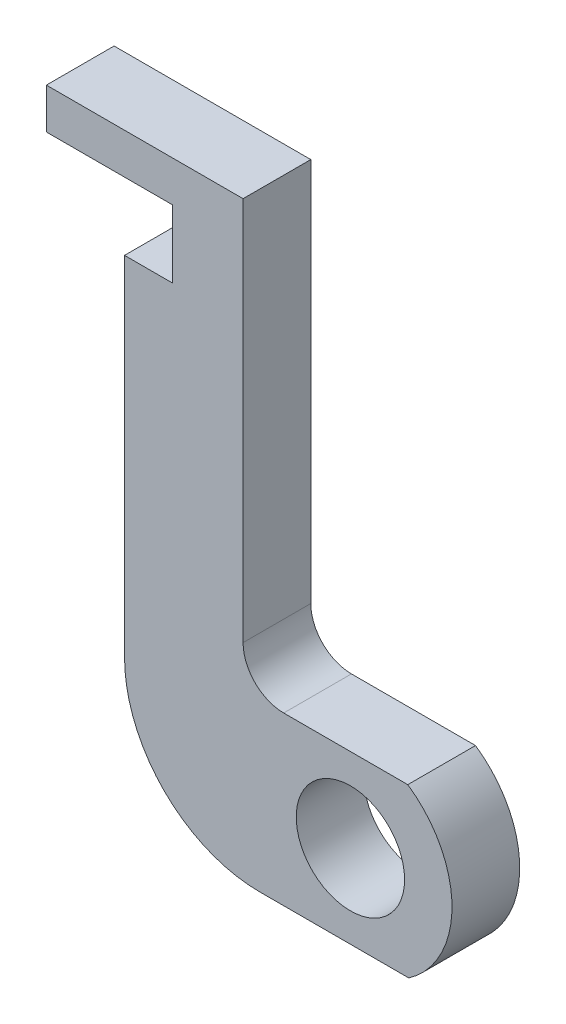
ISO-10303-21;
HEADER;
FILE_DESCRIPTION(('STEP AP214'),'2;1');
FILE_NAME('part.step','',(''),(''),'','','');
FILE_SCHEMA(('AUTOMOTIVE_DESIGN { 1 0 10303 214 1 1 1 1 }'));
ENDSEC;
DATA;
#1=APPLICATION_CONTEXT('core data for automotive mechanical design processes');
#2=APPLICATION_PROTOCOL_DEFINITION('international standard','automotive_design',2000,#1);
#3=PRODUCT_CONTEXT('',#1,'mechanical');
#4=PRODUCT('Part','Part','',(#3));
#5=PRODUCT_RELATED_PRODUCT_CATEGORY('part','',(#4));
#6=PRODUCT_DEFINITION_FORMATION('','',#4);
#7=PRODUCT_DEFINITION_CONTEXT('part definition',#1,'design');
#8=PRODUCT_DEFINITION('design','',#6,#7);
#9=PRODUCT_DEFINITION_SHAPE('','',#8);
#10=(LENGTH_UNIT() NAMED_UNIT(*) SI_UNIT(.MILLI.,.METRE.));
#11=(NAMED_UNIT(*) PLANE_ANGLE_UNIT() SI_UNIT($,.RADIAN.));
#12=(NAMED_UNIT(*) SI_UNIT($,.STERADIAN.) SOLID_ANGLE_UNIT());
#13=UNCERTAINTY_MEASURE_WITH_UNIT(LENGTH_MEASURE(1.E-05),#10,'distance_accuracy_value','');
#14=(GEOMETRIC_REPRESENTATION_CONTEXT(3) GLOBAL_UNCERTAINTY_ASSIGNED_CONTEXT((#13)) GLOBAL_UNIT_ASSIGNED_CONTEXT((#10,
#11,#12)) REPRESENTATION_CONTEXT('',''));
#15=CARTESIAN_POINT('',(0.,0.,0.));
#16=DIRECTION('',(0.,0.,1.));
#17=DIRECTION('',(1.,0.,0.));
#18=AXIS2_PLACEMENT_3D('',#15,#16,#17);
#19=CARTESIAN_POINT('',(0.,0.,5.));
#20=DIRECTION('',(0.,0.,1.));
#21=DIRECTION('',(1.,0.,0.));
#22=AXIS2_PLACEMENT_3D('',#19,#20,#21);
#23=PLANE('',#22);
#24=CARTESIAN_POINT('',(0.,0.,5.));
#25=DIRECTION('',(0.,0.,1.));
#26=DIRECTION('',(1.,0.,0.));
#27=AXIS2_PLACEMENT_3D('',#24,#25,#26);
#28=CIRCLE('',#27,7.5);
#29=CARTESIAN_POINT('',(4.31376244235249,-6.13526312320418,5.));
#30=VERTEX_POINT('',#29);
#31=CARTESIAN_POINT('',(4.23680160030476,6.18865996801044,5.));
#32=VERTEX_POINT('',#31);
#33=EDGE_CURVE('E200',#30,#32,#28,.T.);
#34=ORIENTED_EDGE('',*,*,#33,.T.);
#35=DIRECTION('',(-1.,0.,0.));
#36=VECTOR('',#35,1.);
#37=CARTESIAN_POINT('',(-4.92493801240937,6.18865996801044,5.));
#38=LINE('',#37,#36);
#39=CARTESIAN_POINT('',(-4.92493801240937,6.18865996801044,5.));
#40=VERTEX_POINT('',#39);
#41=EDGE_CURVE('E112',#32,#40,#38,.T.);
#42=ORIENTED_EDGE('',*,*,#41,.T.);
#43=CARTESIAN_POINT('',(-4.92493801240937,9.18865996801044,5.));
#44=DIRECTION('',(0.,0.,-1.));
#45=DIRECTION('',(1.,0.,0.));
#46=AXIS2_PLACEMENT_3D('',#43,#44,#45);
#47=CIRCLE('',#46,3.);
#48=CARTESIAN_POINT('',(-7.92493801240937,9.18865996801044,5.));
#49=VERTEX_POINT('',#48);
#50=EDGE_CURVE('E237',#40,#49,#47,.T.);
#51=ORIENTED_EDGE('',*,*,#50,.T.);
#52=DIRECTION('',(0.,1.,0.));
#53=VECTOR('',#52,1.);
#54=CARTESIAN_POINT('',(-7.92493801240937,37.5743426269877,5.));
#55=LINE('',#54,#53);
#56=CARTESIAN_POINT('',(-7.92493801240937,37.5743426269877,5.));
#57=VERTEX_POINT('',#56);
#58=EDGE_CURVE('E257',#49,#57,#55,.T.);
#59=ORIENTED_EDGE('',*,*,#58,.T.);
#60=DIRECTION('',(-1.,0.,0.));
#61=VECTOR('',#60,1.);
#62=CARTESIAN_POINT('',(-7.92493801240937,37.5743426269877,5.));
#63=LINE('',#62,#61);
#64=CARTESIAN_POINT('',(-22.446516875528,37.5743426269877,5.));
#65=VERTEX_POINT('',#64);
#66=EDGE_CURVE('E253',#57,#65,#63,.T.);
#67=ORIENTED_EDGE('',*,*,#66,.T.);
#68=DIRECTION('',(0.,-1.,0.));
#69=VECTOR('',#68,1.);
#70=CARTESIAN_POINT('',(-22.446516875528,37.5743426269877,5.));
#71=LINE('',#70,#69);
#72=CARTESIAN_POINT('',(-22.446516875528,34.5743426269877,5.));
#73=VERTEX_POINT('',#72);
#74=EDGE_CURVE('E256',#65,#73,#71,.T.);
#75=ORIENTED_EDGE('',*,*,#74,.T.);
#76=DIRECTION('',(1.,0.,0.));
#77=VECTOR('',#76,1.);
#78=CARTESIAN_POINT('',(-22.446516875528,34.5743426269877,5.));
#79=LINE('',#78,#77);
#80=CARTESIAN_POINT('',(-13.1445157543833,34.5743426269877,5.));
#81=VERTEX_POINT('',#80);
#82=EDGE_CURVE('E261',#73,#81,#79,.T.);
#83=ORIENTED_EDGE('',*,*,#82,.T.);
#84=DIRECTION('',(0.,-1.,0.));
#85=VECTOR('',#84,1.);
#86=CARTESIAN_POINT('',(-13.1445157543833,34.5743426269877,5.));
#87=LINE('',#86,#85);
#88=CARTESIAN_POINT('',(-13.1445157543833,29.5743426269877,5.));
#89=VERTEX_POINT('',#88);
#90=EDGE_CURVE('E268',#81,#89,#87,.T.);
#91=ORIENTED_EDGE('',*,*,#90,.T.);
#92=DIRECTION('',(-1.,0.,0.));
#93=VECTOR('',#92,1.);
#94=CARTESIAN_POINT('',(-13.1445157543833,29.5743426269877,5.));
#95=LINE('',#94,#93);
#96=CARTESIAN_POINT('',(-16.6759202012145,29.5743426269877,5.));
#97=VERTEX_POINT('',#96);
#98=EDGE_CURVE('E143',#89,#97,#95,.T.);
#99=ORIENTED_EDGE('',*,*,#98,.T.);
#100=DIRECTION('',(0.,-1.,0.));
#101=VECTOR('',#100,1.);
#102=CARTESIAN_POINT('',(-16.6759202012145,29.5743426269877,5.));
#103=LINE('',#102,#101);
#104=CARTESIAN_POINT('',(-16.6759202012145,3.86473687679582,5.));
#105=VERTEX_POINT('',#104);
#106=EDGE_CURVE('E137',#97,#105,#103,.T.);
#107=ORIENTED_EDGE('',*,*,#106,.T.);
#108=CARTESIAN_POINT('',(-6.6759202012145,3.86473687679582,5.));
#109=DIRECTION('',(0.,0.,1.));
#110=DIRECTION('',(1.,0.,0.));
#111=AXIS2_PLACEMENT_3D('',#108,#109,#110);
#112=CIRCLE('',#111,10.);
#113=CARTESIAN_POINT('',(-6.67592020121451,-6.13526312320418,5.));
#114=VERTEX_POINT('',#113);
#115=EDGE_CURVE('E141',#105,#114,#112,.T.);
#116=ORIENTED_EDGE('',*,*,#115,.T.);
#117=DIRECTION('',(1.,0.,0.));
#118=VECTOR('',#117,1.);
#119=CARTESIAN_POINT('',(-6.6759202012145,-6.13526312320418,5.));
#120=LINE('',#119,#118);
#121=EDGE_CURVE('E57',#114,#30,#120,.T.);
#122=ORIENTED_EDGE('',*,*,#121,.T.);
#123=EDGE_LOOP('',(#34,#42,#51,#59,#67,#75,#83,#91,#99,#107,#116,#122));
#124=FACE_BOUND('',#123,.T.);
#125=CARTESIAN_POINT('',(0.,0.,5.));
#126=DIRECTION('',(0.,0.,1.));
#127=DIRECTION('',(1.,0.,0.));
#128=AXIS2_PLACEMENT_3D('',#125,#126,#127);
#129=CIRCLE('',#128,4.);
#130=CARTESIAN_POINT('',(4.,0.,5.));
#131=VERTEX_POINT('',#130);
#132=EDGE_CURVE('E170',#131,#131,#129,.T.);
#133=ORIENTED_EDGE('',*,*,#132,.F.);
#134=EDGE_LOOP('',(#133));
#135=FACE_BOUND('',#134,.T.);
#136=ADVANCED_FACE('F39',(#124,#135),#23,.T.);
#137=CARTESIAN_POINT('',(0.,0.,0.));
#138=DIRECTION('',(0.,0.,1.));
#139=DIRECTION('',(1.,0.,0.));
#140=AXIS2_PLACEMENT_3D('',#137,#138,#139);
#141=PLANE('',#140);
#142=CARTESIAN_POINT('',(0.,0.,0.));
#143=DIRECTION('',(0.,0.,1.));
#144=DIRECTION('',(1.,0.,0.));
#145=AXIS2_PLACEMENT_3D('',#142,#143,#144);
#146=CIRCLE('',#145,7.5);
#147=CARTESIAN_POINT('',(4.31376244235249,-6.13526312320418,0.));
#148=VERTEX_POINT('',#147);
#149=CARTESIAN_POINT('',(4.23680160030476,6.18865996801044,0.));
#150=VERTEX_POINT('',#149);
#151=EDGE_CURVE('E165',#148,#150,#146,.T.);
#152=ORIENTED_EDGE('',*,*,#151,.F.);
#153=DIRECTION('',(1.,0.,0.));
#154=VECTOR('',#153,1.);
#155=CARTESIAN_POINT('',(-6.6759202012145,-6.13526312320418,0.));
#156=LINE('',#155,#154);
#157=CARTESIAN_POINT('',(-6.67592020121451,-6.13526312320418,0.));
#158=VERTEX_POINT('',#157);
#159=EDGE_CURVE('E104',#158,#148,#156,.T.);
#160=ORIENTED_EDGE('',*,*,#159,.F.);
#161=CARTESIAN_POINT('',(-6.6759202012145,3.86473687679582,0.));
#162=DIRECTION('',(0.,0.,1.));
#163=DIRECTION('',(1.,0.,0.));
#164=AXIS2_PLACEMENT_3D('',#161,#162,#163);
#165=CIRCLE('',#164,10.);
#166=CARTESIAN_POINT('',(-16.6759202012145,3.86473687679582,0.));
#167=VERTEX_POINT('',#166);
#168=EDGE_CURVE('E98',#167,#158,#165,.T.);
#169=ORIENTED_EDGE('',*,*,#168,.F.);
#170=DIRECTION('',(0.,-1.,0.));
#171=VECTOR('',#170,1.);
#172=CARTESIAN_POINT('',(-16.6759202012145,29.5743426269877,0.));
#173=LINE('',#172,#171);
#174=CARTESIAN_POINT('',(-16.6759202012145,29.5743426269877,0.));
#175=VERTEX_POINT('',#174);
#176=EDGE_CURVE('E152',#175,#167,#173,.T.);
#177=ORIENTED_EDGE('',*,*,#176,.F.);
#178=DIRECTION('',(-1.,0.,0.));
#179=VECTOR('',#178,1.);
#180=CARTESIAN_POINT('',(-13.1445157543833,29.5743426269877,0.));
#181=LINE('',#180,#179);
#182=CARTESIAN_POINT('',(-13.1445157543833,29.5743426269877,0.));
#183=VERTEX_POINT('',#182);
#184=EDGE_CURVE('E191',#183,#175,#181,.T.);
#185=ORIENTED_EDGE('',*,*,#184,.F.);
#186=DIRECTION('',(0.,-1.,0.));
#187=VECTOR('',#186,1.);
#188=CARTESIAN_POINT('',(-13.1445157543833,34.5743426269877,0.));
#189=LINE('',#188,#187);
#190=CARTESIAN_POINT('',(-13.1445157543833,34.5743426269877,0.));
#191=VERTEX_POINT('',#190);
#192=EDGE_CURVE('E188',#191,#183,#189,.T.);
#193=ORIENTED_EDGE('',*,*,#192,.F.);
#194=DIRECTION('',(1.,0.,0.));
#195=VECTOR('',#194,1.);
#196=CARTESIAN_POINT('',(-22.446516875528,34.5743426269877,0.));
#197=LINE('',#196,#195);
#198=CARTESIAN_POINT('',(-22.446516875528,34.5743426269877,0.));
#199=VERTEX_POINT('',#198);
#200=EDGE_CURVE('E185',#199,#191,#197,.T.);
#201=ORIENTED_EDGE('',*,*,#200,.F.);
#202=DIRECTION('',(0.,-1.,0.));
#203=VECTOR('',#202,1.);
#204=CARTESIAN_POINT('',(-22.446516875528,37.5743426269877,0.));
#205=LINE('',#204,#203);
#206=CARTESIAN_POINT('',(-22.446516875528,37.5743426269877,0.));
#207=VERTEX_POINT('',#206);
#208=EDGE_CURVE('E182',#207,#199,#205,.T.);
#209=ORIENTED_EDGE('',*,*,#208,.F.);
#210=DIRECTION('',(-1.,0.,0.));
#211=VECTOR('',#210,1.);
#212=CARTESIAN_POINT('',(-7.92493801240937,37.5743426269877,0.));
#213=LINE('',#212,#211);
#214=CARTESIAN_POINT('',(-7.92493801240937,37.5743426269877,0.));
#215=VERTEX_POINT('',#214);
#216=EDGE_CURVE('E179',#215,#207,#213,.T.);
#217=ORIENTED_EDGE('',*,*,#216,.F.);
#218=DIRECTION('',(0.,1.,0.));
#219=VECTOR('',#218,1.);
#220=CARTESIAN_POINT('',(-7.92493801240937,37.5743426269877,0.));
#221=LINE('',#220,#219);
#222=CARTESIAN_POINT('',(-7.92493801240937,9.18865996801044,0.));
#223=VERTEX_POINT('',#222);
#224=EDGE_CURVE('E176',#223,#215,#221,.T.);
#225=ORIENTED_EDGE('',*,*,#224,.F.);
#226=CARTESIAN_POINT('',(-4.92493801240937,9.18865996801044,0.));
#227=DIRECTION('',(0.,0.,-1.));
#228=DIRECTION('',(1.,0.,0.));
#229=AXIS2_PLACEMENT_3D('',#226,#227,#228);
#230=CIRCLE('',#229,3.);
#231=CARTESIAN_POINT('',(-4.92493801240937,6.18865996801044,0.));
#232=VERTEX_POINT('',#231);
#233=EDGE_CURVE('E173',#232,#223,#230,.T.);
#234=ORIENTED_EDGE('',*,*,#233,.F.);
#235=DIRECTION('',(-1.,0.,0.));
#236=VECTOR('',#235,1.);
#237=CARTESIAN_POINT('',(-4.92493801240937,6.18865996801044,0.));
#238=LINE('',#237,#236);
#239=EDGE_CURVE('E169',#150,#232,#238,.T.);
#240=ORIENTED_EDGE('',*,*,#239,.F.);
#241=EDGE_LOOP('',(#152,#160,#169,#177,#185,#193,#201,#209,#217,#225,#234,#240));
#242=FACE_BOUND('',#241,.T.);
#243=CARTESIAN_POINT('',(0.,0.,0.));
#244=DIRECTION('',(0.,0.,1.));
#245=DIRECTION('',(1.,0.,0.));
#246=AXIS2_PLACEMENT_3D('',#243,#244,#245);
#247=CIRCLE('',#246,4.);
#248=CARTESIAN_POINT('',(4.,0.,0.));
#249=VERTEX_POINT('',#248);
#250=EDGE_CURVE('E417',#249,#249,#247,.T.);
#251=ORIENTED_EDGE('',*,*,#250,.T.);
#252=EDGE_LOOP('',(#251));
#253=FACE_BOUND('',#252,.T.);
#254=ADVANCED_FACE('F241',(#242,#253),#141,.F.);
#255=CARTESIAN_POINT('',(0.,0.,5.));
#256=DIRECTION('',(0.,0.,-1.));
#257=DIRECTION('',(-1.,0.,0.));
#258=AXIS2_PLACEMENT_3D('',#255,#256,#257);
#259=CYLINDRICAL_SURFACE('',#258,7.5);
#260=ORIENTED_EDGE('',*,*,#151,.T.);
#261=DIRECTION('',(0.,0.,-1.));
#262=VECTOR('',#261,1.);
#263=CARTESIAN_POINT('',(4.23680160030476,6.18865996801044,5.));
#264=LINE('',#263,#262);
#265=EDGE_CURVE('E11',#32,#150,#264,.T.);
#266=ORIENTED_EDGE('',*,*,#265,.F.);
#267=ORIENTED_EDGE('',*,*,#33,.F.);
#268=DIRECTION('',(0.,0.,-1.));
#269=VECTOR('',#268,1.);
#270=CARTESIAN_POINT('',(4.31376244235249,-6.13526312320418,5.));
#271=LINE('',#270,#269);
#272=EDGE_CURVE('E161',#30,#148,#271,.T.);
#273=ORIENTED_EDGE('',*,*,#272,.T.);
#274=EDGE_LOOP('',(#260,#266,#267,#273));
#275=FACE_BOUND('',#274,.T.);
#276=ADVANCED_FACE('F41',(#275),#259,.T.);
#277=CARTESIAN_POINT('',(-4.92493801240937,6.18865996801044,5.));
#278=DIRECTION('',(0.,-1.,0.));
#279=DIRECTION('',(0.,0.,-1.));
#280=AXIS2_PLACEMENT_3D('',#277,#278,#279);
#281=PLANE('',#280);
#282=ORIENTED_EDGE('',*,*,#239,.T.);
#283=DIRECTION('',(0.,0.,-1.));
#284=VECTOR('',#283,1.);
#285=CARTESIAN_POINT('',(-4.92493801240937,6.18865996801044,5.));
#286=LINE('',#285,#284);
#287=EDGE_CURVE('E49',#40,#232,#286,.T.);
#288=ORIENTED_EDGE('',*,*,#287,.F.);
#289=ORIENTED_EDGE('',*,*,#41,.F.);
#290=ORIENTED_EDGE('',*,*,#265,.T.);
#291=EDGE_LOOP('',(#282,#288,#289,#290));
#292=FACE_BOUND('',#291,.T.);
#293=ADVANCED_FACE('F304',(#292),#281,.F.);
#294=CARTESIAN_POINT('',(-4.92493801240937,9.18865996801044,5.));
#295=DIRECTION('',(0.,0.,-1.));
#296=DIRECTION('',(-1.,0.,0.));
#297=AXIS2_PLACEMENT_3D('',#294,#295,#296);
#298=CYLINDRICAL_SURFACE('',#297,3.);
#299=ORIENTED_EDGE('',*,*,#233,.T.);
#300=DIRECTION('',(0.,0.,-1.));
#301=VECTOR('',#300,1.);
#302=CARTESIAN_POINT('',(-7.92493801240937,9.18865996801044,5.));
#303=LINE('',#302,#301);
#304=EDGE_CURVE('E227',#49,#223,#303,.T.);
#305=ORIENTED_EDGE('',*,*,#304,.F.);
#306=ORIENTED_EDGE('',*,*,#50,.F.);
#307=ORIENTED_EDGE('',*,*,#287,.T.);
#308=EDGE_LOOP('',(#299,#305,#306,#307));
#309=FACE_BOUND('',#308,.T.);
#310=ADVANCED_FACE('F235',(#309),#298,.F.);
#311=CARTESIAN_POINT('',(-7.92493801240937,37.5743426269877,5.));
#312=DIRECTION('',(-1.,0.,0.));
#313=DIRECTION('',(0.,-1.,0.));
#314=AXIS2_PLACEMENT_3D('',#311,#312,#313);
#315=PLANE('',#314);
#316=ORIENTED_EDGE('',*,*,#224,.T.);
#317=DIRECTION('',(0.,0.,-1.));
#318=VECTOR('',#317,1.);
#319=CARTESIAN_POINT('',(-7.92493801240937,37.5743426269877,5.));
#320=LINE('',#319,#318);
#321=EDGE_CURVE('E223',#57,#215,#320,.T.);
#322=ORIENTED_EDGE('',*,*,#321,.F.);
#323=ORIENTED_EDGE('',*,*,#58,.F.);
#324=ORIENTED_EDGE('',*,*,#304,.T.);
#325=EDGE_LOOP('',(#316,#322,#323,#324));
#326=FACE_BOUND('',#325,.T.);
#327=ADVANCED_FACE('F247',(#326),#315,.F.);
#328=CARTESIAN_POINT('',(-7.92493801240937,37.5743426269877,5.));
#329=DIRECTION('',(0.,-1.,0.));
#330=DIRECTION('',(0.,0.,-1.));
#331=AXIS2_PLACEMENT_3D('',#328,#329,#330);
#332=PLANE('',#331);
#333=ORIENTED_EDGE('',*,*,#216,.T.);
#334=DIRECTION('',(0.,0.,-1.));
#335=VECTOR('',#334,1.);
#336=CARTESIAN_POINT('',(-22.446516875528,37.5743426269877,5.));
#337=LINE('',#336,#335);
#338=EDGE_CURVE('E219',#65,#207,#337,.T.);
#339=ORIENTED_EDGE('',*,*,#338,.F.);
#340=ORIENTED_EDGE('',*,*,#66,.F.);
#341=ORIENTED_EDGE('',*,*,#321,.T.);
#342=EDGE_LOOP('',(#333,#339,#340,#341));
#343=FACE_BOUND('',#342,.T.);
#344=ADVANCED_FACE('F251',(#343),#332,.F.);
#345=CARTESIAN_POINT('',(-22.446516875528,37.5743426269877,5.));
#346=DIRECTION('',(1.,0.,0.));
#347=DIRECTION('',(0.,0.,-1.));
#348=AXIS2_PLACEMENT_3D('',#345,#346,#347);
#349=PLANE('',#348);
#350=ORIENTED_EDGE('',*,*,#208,.T.);
#351=DIRECTION('',(0.,0.,-1.));
#352=VECTOR('',#351,1.);
#353=CARTESIAN_POINT('',(-22.446516875528,34.5743426269877,5.));
#354=LINE('',#353,#352);
#355=EDGE_CURVE('E215',#73,#199,#354,.T.);
#356=ORIENTED_EDGE('',*,*,#355,.F.);
#357=ORIENTED_EDGE('',*,*,#74,.F.);
#358=ORIENTED_EDGE('',*,*,#338,.T.);
#359=EDGE_LOOP('',(#350,#356,#357,#358));
#360=FACE_BOUND('',#359,.T.);
#361=ADVANCED_FACE('F317',(#360),#349,.F.);
#362=CARTESIAN_POINT('',(-22.446516875528,34.5743426269877,5.));
#363=DIRECTION('',(0.,1.,0.));
#364=DIRECTION('',(0.,0.,1.));
#365=AXIS2_PLACEMENT_3D('',#362,#363,#364);
#366=PLANE('',#365);
#367=ORIENTED_EDGE('',*,*,#200,.T.);
#368=DIRECTION('',(0.,0.,-1.));
#369=VECTOR('',#368,1.);
#370=CARTESIAN_POINT('',(-13.1445157543833,34.5743426269877,5.));
#371=LINE('',#370,#369);
#372=EDGE_CURVE('E211',#81,#191,#371,.T.);
#373=ORIENTED_EDGE('',*,*,#372,.F.);
#374=ORIENTED_EDGE('',*,*,#82,.F.);
#375=ORIENTED_EDGE('',*,*,#355,.T.);
#376=EDGE_LOOP('',(#367,#373,#374,#375));
#377=FACE_BOUND('',#376,.T.);
#378=ADVANCED_FACE('F320',(#377),#366,.F.);
#379=CARTESIAN_POINT('',(-13.1445157543833,34.5743426269877,5.));
#380=DIRECTION('',(1.,0.,0.));
#381=DIRECTION('',(0.,0.,-1.));
#382=AXIS2_PLACEMENT_3D('',#379,#380,#381);
#383=PLANE('',#382);
#384=ORIENTED_EDGE('',*,*,#192,.T.);
#385=DIRECTION('',(0.,0.,-1.));
#386=VECTOR('',#385,1.);
#387=CARTESIAN_POINT('',(-13.1445157543833,29.5743426269877,5.));
#388=LINE('',#387,#386);
#389=EDGE_CURVE('E207',#89,#183,#388,.T.);
#390=ORIENTED_EDGE('',*,*,#389,.F.);
#391=ORIENTED_EDGE('',*,*,#90,.F.);
#392=ORIENTED_EDGE('',*,*,#372,.T.);
#393=EDGE_LOOP('',(#384,#390,#391,#392));
#394=FACE_BOUND('',#393,.T.);
#395=ADVANCED_FACE('F276',(#394),#383,.F.);
#396=CARTESIAN_POINT('',(-13.1445157543833,29.5743426269877,5.));
#397=DIRECTION('',(0.,-1.,0.));
#398=DIRECTION('',(1.,0.,0.));
#399=AXIS2_PLACEMENT_3D('',#396,#397,#398);
#400=PLANE('',#399);
#401=ORIENTED_EDGE('',*,*,#184,.T.);
#402=DIRECTION('',(0.,0.,-1.));
#403=VECTOR('',#402,1.);
#404=CARTESIAN_POINT('',(-16.6759202012145,29.5743426269877,5.));
#405=LINE('',#404,#403);
#406=EDGE_CURVE('E154',#97,#175,#405,.T.);
#407=ORIENTED_EDGE('',*,*,#406,.F.);
#408=ORIENTED_EDGE('',*,*,#98,.F.);
#409=ORIENTED_EDGE('',*,*,#389,.T.);
#410=EDGE_LOOP('',(#401,#407,#408,#409));
#411=FACE_BOUND('',#410,.T.);
#412=ADVANCED_FACE('F280',(#411),#400,.F.);
#413=CARTESIAN_POINT('',(-16.6759202012145,29.5743426269877,5.));
#414=DIRECTION('',(1.,0.,0.));
#415=DIRECTION('',(0.,1.,0.));
#416=AXIS2_PLACEMENT_3D('',#413,#414,#415);
#417=PLANE('',#416);
#418=ORIENTED_EDGE('',*,*,#176,.T.);
#419=DIRECTION('',(0.,0.,-1.));
#420=VECTOR('',#419,1.);
#421=CARTESIAN_POINT('',(-16.6759202012145,3.86473687679582,5.));
#422=LINE('',#421,#420);
#423=EDGE_CURVE('E149',#105,#167,#422,.T.);
#424=ORIENTED_EDGE('',*,*,#423,.F.);
#425=ORIENTED_EDGE('',*,*,#106,.F.);
#426=ORIENTED_EDGE('',*,*,#406,.T.);
#427=EDGE_LOOP('',(#418,#424,#425,#426));
#428=FACE_BOUND('',#427,.T.);
#429=ADVANCED_FACE('F150',(#428),#417,.F.);
#430=CARTESIAN_POINT('',(-6.6759202012145,3.86473687679582,5.));
#431=DIRECTION('',(0.,0.,-1.));
#432=DIRECTION('',(-1.,0.,0.));
#433=AXIS2_PLACEMENT_3D('',#430,#431,#432);
#434=CYLINDRICAL_SURFACE('',#433,10.);
#435=ORIENTED_EDGE('',*,*,#168,.T.);
#436=DIRECTION('',(0.,0.,-1.));
#437=VECTOR('',#436,1.);
#438=CARTESIAN_POINT('',(-6.67592020121451,-6.13526312320418,5.));
#439=LINE('',#438,#437);
#440=EDGE_CURVE('E155',#114,#158,#439,.T.);
#441=ORIENTED_EDGE('',*,*,#440,.F.);
#442=ORIENTED_EDGE('',*,*,#115,.F.);
#443=ORIENTED_EDGE('',*,*,#423,.T.);
#444=EDGE_LOOP('',(#435,#441,#442,#443));
#445=FACE_BOUND('',#444,.T.);
#446=ADVANCED_FACE('F157',(#445),#434,.T.);
#447=CARTESIAN_POINT('',(-6.6759202012145,-6.13526312320418,5.));
#448=DIRECTION('',(0.,1.,0.));
#449=DIRECTION('',(0.,0.,1.));
#450=AXIS2_PLACEMENT_3D('',#447,#448,#449);
#451=PLANE('',#450);
#452=ORIENTED_EDGE('',*,*,#159,.T.);
#453=ORIENTED_EDGE('',*,*,#272,.F.);
#454=ORIENTED_EDGE('',*,*,#121,.F.);
#455=ORIENTED_EDGE('',*,*,#440,.T.);
#456=EDGE_LOOP('',(#452,#453,#454,#455));
#457=FACE_BOUND('',#456,.T.);
#458=ADVANCED_FACE('F284',(#457),#451,.F.);
#459=CARTESIAN_POINT('',(0.,0.,5.));
#460=DIRECTION('',(0.,0.,-1.));
#461=DIRECTION('',(-1.,0.,0.));
#462=AXIS2_PLACEMENT_3D('',#459,#460,#461);
#463=CYLINDRICAL_SURFACE('',#462,4.);
#464=ORIENTED_EDGE('',*,*,#132,.T.);
#465=EDGE_LOOP('',(#464));
#466=FACE_BOUND('',#465,.T.);
#467=ORIENTED_EDGE('',*,*,#250,.F.);
#468=EDGE_LOOP('',(#467));
#469=FACE_BOUND('',#468,.T.);
#470=ADVANCED_FACE('F286',(#466,#469),#463,.F.);
#471=CLOSED_SHELL('',(#136,#254,#276,#293,#310,#327,#344,#361,#378,#395,#412,#429,#446,#458,#470));
#472=MANIFOLD_SOLID_BREP('B2',#471);
#473=ADVANCED_BREP_SHAPE_REPRESENTATION('',(#18,#472),#14);
#474=SHAPE_DEFINITION_REPRESENTATION(#9,#473);
ENDSEC;
END-ISO-10303-21;
